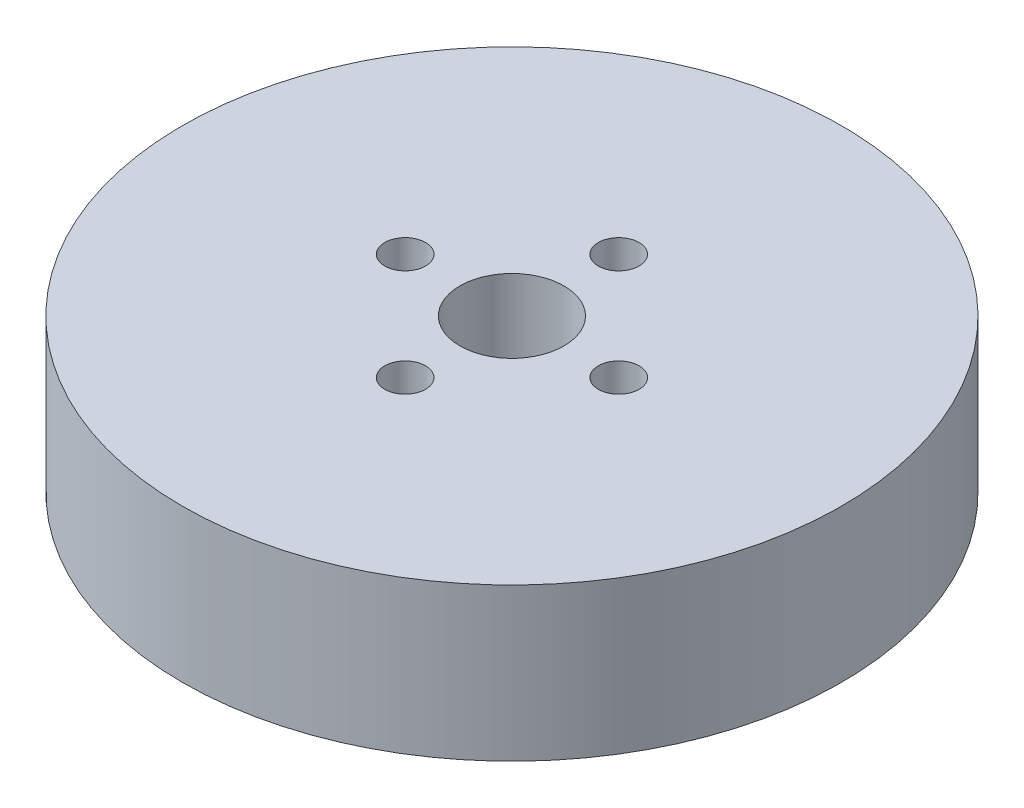
ISO-10303-21;
HEADER;
FILE_DESCRIPTION(('STEP AP214'),'2;1');
FILE_NAME('part.step','',(''),(''),'','','');
FILE_SCHEMA(('AUTOMOTIVE_DESIGN { 1 0 10303 214 1 1 1 1 }'));
ENDSEC;
DATA;
#1=APPLICATION_CONTEXT('core data for automotive mechanical design processes');
#2=APPLICATION_PROTOCOL_DEFINITION('international standard','automotive_design',2000,#1);
#3=PRODUCT_CONTEXT('',#1,'mechanical');
#4=PRODUCT('Part','Part','',(#3));
#5=PRODUCT_RELATED_PRODUCT_CATEGORY('part','',(#4));
#6=PRODUCT_DEFINITION_FORMATION('','',#4);
#7=PRODUCT_DEFINITION_CONTEXT('part definition',#1,'design');
#8=PRODUCT_DEFINITION('design','',#6,#7);
#9=PRODUCT_DEFINITION_SHAPE('','',#8);
#10=(LENGTH_UNIT() NAMED_UNIT(*) SI_UNIT(.MILLI.,.METRE.));
#11=(NAMED_UNIT(*) PLANE_ANGLE_UNIT() SI_UNIT($,.RADIAN.));
#12=(NAMED_UNIT(*) SI_UNIT($,.STERADIAN.) SOLID_ANGLE_UNIT());
#13=UNCERTAINTY_MEASURE_WITH_UNIT(LENGTH_MEASURE(1.E-05),#10,'distance_accuracy_value','');
#14=(GEOMETRIC_REPRESENTATION_CONTEXT(3) GLOBAL_UNCERTAINTY_ASSIGNED_CONTEXT((#13)) GLOBAL_UNIT_ASSIGNED_CONTEXT((#10,
#11,#12)) REPRESENTATION_CONTEXT('',''));
#15=CARTESIAN_POINT('',(0.,0.,0.));
#16=DIRECTION('',(0.,0.,1.));
#17=DIRECTION('',(1.,0.,0.));
#18=AXIS2_PLACEMENT_3D('',#15,#16,#17);
#19=CARTESIAN_POINT('',(0.,22.,0.));
#20=DIRECTION('',(0.,-1.,0.));
#21=DIRECTION('',(0.,0.,-1.));
#22=AXIS2_PLACEMENT_3D('',#19,#20,#21);
#23=CYLINDRICAL_SURFACE('',#22,47.5);
#24=CARTESIAN_POINT('',(0.,22.,0.));
#25=DIRECTION('',(0.,1.,0.));
#26=DIRECTION('',(0.,0.,1.));
#27=AXIS2_PLACEMENT_3D('',#24,#25,#26);
#28=CIRCLE('',#27,47.5);
#29=CARTESIAN_POINT('',(0.,22.,47.5));
#30=VERTEX_POINT('',#29);
#31=EDGE_CURVE('E10',#30,#30,#28,.T.);
#32=ORIENTED_EDGE('',*,*,#31,.F.);
#33=EDGE_LOOP('',(#32));
#34=FACE_BOUND('',#33,.T.);
#35=CARTESIAN_POINT('',(0.,0.,0.));
#36=DIRECTION('',(0.,1.,0.));
#37=DIRECTION('',(0.,0.,1.));
#38=AXIS2_PLACEMENT_3D('',#35,#36,#37);
#39=CIRCLE('',#38,47.5);
#40=CARTESIAN_POINT('',(0.,0.,47.5));
#41=VERTEX_POINT('',#40);
#42=EDGE_CURVE('E37',#41,#41,#39,.T.);
#43=ORIENTED_EDGE('',*,*,#42,.T.);
#44=EDGE_LOOP('',(#43));
#45=FACE_BOUND('',#44,.T.);
#46=ADVANCED_FACE('F40',(#34,#45),#23,.T.);
#47=CARTESIAN_POINT('',(0.,22.,0.));
#48=DIRECTION('',(0.,1.,0.));
#49=DIRECTION('',(0.,0.,1.));
#50=AXIS2_PLACEMENT_3D('',#47,#48,#49);
#51=PLANE('',#50);
#52=CARTESIAN_POINT('',(0.,22.,15.3892783760193));
#53=DIRECTION('',(0.,1.,0.));
#54=DIRECTION('',(1.,0.,0.));
#55=AXIS2_PLACEMENT_3D('',#52,#53,#54);
#56=CIRCLE('',#55,2.9412530173602);
#57=CARTESIAN_POINT('',(2.94125301736025,22.,15.3892783760193));
#58=VERTEX_POINT('',#57);
#59=EDGE_CURVE('E71',#58,#58,#56,.T.);
#60=ORIENTED_EDGE('',*,*,#59,.F.);
#61=EDGE_LOOP('',(#60));
#62=FACE_BOUND('',#61,.T.);
#63=CARTESIAN_POINT('',(15.3892783760193,22.,0.));
#64=DIRECTION('',(0.,1.,0.));
#65=DIRECTION('',(0.,0.,-1.));
#66=AXIS2_PLACEMENT_3D('',#63,#64,#65);
#67=CIRCLE('',#66,2.9412530173602);
#68=CARTESIAN_POINT('',(15.3892783760193,22.,-2.9412530173602));
#69=VERTEX_POINT('',#68);
#70=EDGE_CURVE('E70',#69,#69,#67,.T.);
#71=ORIENTED_EDGE('',*,*,#70,.F.);
#72=EDGE_LOOP('',(#71));
#73=FACE_BOUND('',#72,.T.);
#74=CARTESIAN_POINT('',(-1.61194134804401E-13,22.,-15.3892783760193));
#75=DIRECTION('',(0.,1.,0.));
#76=DIRECTION('',(-1.,0.,0.));
#77=AXIS2_PLACEMENT_3D('',#74,#75,#76);
#78=CIRCLE('',#77,2.9412530173602);
#79=CARTESIAN_POINT('',(-2.94125301736036,22.,-15.3892783760193));
#80=VERTEX_POINT('',#79);
#81=EDGE_CURVE('E61',#80,#80,#78,.T.);
#82=ORIENTED_EDGE('',*,*,#81,.F.);
#83=EDGE_LOOP('',(#82));
#84=FACE_BOUND('',#83,.T.);
#85=CARTESIAN_POINT('',(-15.3892783760193,22.,0.));
#86=DIRECTION('',(0.,1.,0.));
#87=DIRECTION('',(0.,0.,1.));
#88=AXIS2_PLACEMENT_3D('',#85,#86,#87);
#89=CIRCLE('',#88,2.9412530173602);
#90=CARTESIAN_POINT('',(-15.3892783760193,22.,2.9412530173602));
#91=VERTEX_POINT('',#90);
#92=EDGE_CURVE('E54',#91,#91,#89,.T.);
#93=ORIENTED_EDGE('',*,*,#92,.F.);
#94=EDGE_LOOP('',(#93));
#95=FACE_BOUND('',#94,.T.);
#96=CARTESIAN_POINT('',(0.,22.,0.));
#97=DIRECTION('',(0.,1.,0.));
#98=DIRECTION('',(0.,0.,1.));
#99=AXIS2_PLACEMENT_3D('',#96,#97,#98);
#100=CIRCLE('',#99,7.5);
#101=CARTESIAN_POINT('',(0.,22.,7.5));
#102=VERTEX_POINT('',#101);
#103=EDGE_CURVE('E50',#102,#102,#100,.T.);
#104=ORIENTED_EDGE('',*,*,#103,.F.);
#105=EDGE_LOOP('',(#104));
#106=FACE_BOUND('',#105,.T.);
#107=ORIENTED_EDGE('',*,*,#31,.T.);
#108=EDGE_LOOP('',(#107));
#109=FACE_BOUND('',#108,.T.);
#110=ADVANCED_FACE('F86',(#62,#73,#84,#95,#106,#109),#51,.T.);
#111=CARTESIAN_POINT('',(0.,0.,0.));
#112=DIRECTION('',(0.,1.,0.));
#113=DIRECTION('',(0.,0.,1.));
#114=AXIS2_PLACEMENT_3D('',#111,#112,#113);
#115=PLANE('',#114);
#116=CARTESIAN_POINT('',(0.,0.,0.));
#117=DIRECTION('',(0.,1.,0.));
#118=DIRECTION('',(0.,0.,1.));
#119=AXIS2_PLACEMENT_3D('',#116,#117,#118);
#120=CIRCLE('',#119,7.5);
#121=CARTESIAN_POINT('',(0.,0.,7.5));
#122=VERTEX_POINT('',#121);
#123=EDGE_CURVE('E47',#122,#122,#120,.T.);
#124=ORIENTED_EDGE('',*,*,#123,.T.);
#125=EDGE_LOOP('',(#124));
#126=FACE_BOUND('',#125,.T.);
#127=ORIENTED_EDGE('',*,*,#42,.F.);
#128=EDGE_LOOP('',(#127));
#129=FACE_BOUND('',#128,.T.);
#130=ADVANCED_FACE('F93',(#126,#129),#115,.F.);
#131=CARTESIAN_POINT('',(0.,22.,0.));
#132=DIRECTION('',(0.,-1.,0.));
#133=DIRECTION('',(0.,0.,-1.));
#134=AXIS2_PLACEMENT_3D('',#131,#132,#133);
#135=CYLINDRICAL_SURFACE('',#134,7.5);
#136=ORIENTED_EDGE('',*,*,#103,.T.);
#137=EDGE_LOOP('',(#136));
#138=FACE_BOUND('',#137,.T.);
#139=ORIENTED_EDGE('',*,*,#123,.F.);
#140=EDGE_LOOP('',(#139));
#141=FACE_BOUND('',#140,.T.);
#142=ADVANCED_FACE('F101',(#138,#141),#135,.F.);
#143=CARTESIAN_POINT('',(-15.3892783760193,4.77755691527927,0.));
#144=DIRECTION('',(0.,1.,0.));
#145=DIRECTION('',(0.,0.,1.));
#146=AXIS2_PLACEMENT_3D('',#143,#144,#145);
#147=CYLINDRICAL_SURFACE('',#146,2.9412530173602);
#148=CARTESIAN_POINT('',(-15.3892783760193,4.77755691527927,0.));
#149=DIRECTION('',(0.,1.,0.));
#150=DIRECTION('',(0.,0.,1.));
#151=AXIS2_PLACEMENT_3D('',#148,#149,#150);
#152=CIRCLE('',#151,2.9412530173602);
#153=CARTESIAN_POINT('',(-15.3892783760193,4.77755691527927,2.9412530173602));
#154=VERTEX_POINT('',#153);
#155=EDGE_CURVE('E55',#154,#154,#152,.T.);
#156=ORIENTED_EDGE('',*,*,#155,.F.);
#157=EDGE_LOOP('',(#156));
#158=FACE_BOUND('',#157,.T.);
#159=ORIENTED_EDGE('',*,*,#92,.T.);
#160=EDGE_LOOP('',(#159));
#161=FACE_BOUND('',#160,.T.);
#162=ADVANCED_FACE('F102',(#158,#161),#147,.F.);
#163=CARTESIAN_POINT('',(-15.3892783760193,4.77755691527927,0.));
#164=DIRECTION('',(0.,1.,0.));
#165=DIRECTION('',(0.,0.,1.));
#166=AXIS2_PLACEMENT_3D('',#163,#164,#165);
#167=PLANE('',#166);
#168=ORIENTED_EDGE('',*,*,#155,.T.);
#169=EDGE_LOOP('',(#168));
#170=FACE_BOUND('',#169,.T.);
#171=ADVANCED_FACE('F133',(#170),#167,.T.);
#172=CARTESIAN_POINT('',(-1.61194134804401E-13,4.77755691527927,-15.3892783760193));
#173=DIRECTION('',(0.,1.,0.));
#174=DIRECTION('',(0.,0.,1.));
#175=AXIS2_PLACEMENT_3D('',#172,#173,#174);
#176=CYLINDRICAL_SURFACE('',#175,2.9412530173602);
#177=CARTESIAN_POINT('',(-1.61194134804401E-13,4.77755691527927,-15.3892783760193));
#178=DIRECTION('',(0.,1.,0.));
#179=DIRECTION('',(-1.,0.,0.));
#180=AXIS2_PLACEMENT_3D('',#177,#178,#179);
#181=CIRCLE('',#180,2.9412530173602);
#182=CARTESIAN_POINT('',(-2.94125301736036,4.77755691527927,-15.3892783760193));
#183=VERTEX_POINT('',#182);
#184=EDGE_CURVE('E63',#183,#183,#181,.T.);
#185=ORIENTED_EDGE('',*,*,#184,.F.);
#186=EDGE_LOOP('',(#185));
#187=FACE_BOUND('',#186,.T.);
#188=ORIENTED_EDGE('',*,*,#81,.T.);
#189=EDGE_LOOP('',(#188));
#190=FACE_BOUND('',#189,.T.);
#191=ADVANCED_FACE('F142',(#187,#190),#176,.F.);
#192=CARTESIAN_POINT('',(-1.61194134804401E-13,4.77755691527927,-15.3892783760193));
#193=DIRECTION('',(0.,1.,0.));
#194=DIRECTION('',(-1.,0.,0.));
#195=AXIS2_PLACEMENT_3D('',#192,#193,#194);
#196=PLANE('',#195);
#197=ORIENTED_EDGE('',*,*,#184,.T.);
#198=EDGE_LOOP('',(#197));
#199=FACE_BOUND('',#198,.T.);
#200=ADVANCED_FACE('F156',(#199),#196,.T.);
#201=CARTESIAN_POINT('',(15.3892783760193,4.77755691527927,0.));
#202=DIRECTION('',(0.,1.,0.));
#203=DIRECTION('',(0.,0.,1.));
#204=AXIS2_PLACEMENT_3D('',#201,#202,#203);
#205=CYLINDRICAL_SURFACE('',#204,2.9412530173602);
#206=CARTESIAN_POINT('',(15.3892783760193,4.77755691527927,0.));
#207=DIRECTION('',(0.,1.,0.));
#208=DIRECTION('',(0.,0.,-1.));
#209=AXIS2_PLACEMENT_3D('',#206,#207,#208);
#210=CIRCLE('',#209,2.9412530173602);
#211=CARTESIAN_POINT('',(15.3892783760193,4.77755691527927,-2.9412530173602));
#212=VERTEX_POINT('',#211);
#213=EDGE_CURVE('E69',#212,#212,#210,.T.);
#214=ORIENTED_EDGE('',*,*,#213,.F.);
#215=EDGE_LOOP('',(#214));
#216=FACE_BOUND('',#215,.T.);
#217=ORIENTED_EDGE('',*,*,#70,.T.);
#218=EDGE_LOOP('',(#217));
#219=FACE_BOUND('',#218,.T.);
#220=ADVANCED_FACE('F164',(#216,#219),#205,.F.);
#221=CARTESIAN_POINT('',(15.3892783760193,4.77755691527927,0.));
#222=DIRECTION('',(0.,1.,0.));
#223=DIRECTION('',(0.,0.,-1.));
#224=AXIS2_PLACEMENT_3D('',#221,#222,#223);
#225=PLANE('',#224);
#226=ORIENTED_EDGE('',*,*,#213,.T.);
#227=EDGE_LOOP('',(#226));
#228=FACE_BOUND('',#227,.T.);
#229=ADVANCED_FACE('F83',(#228),#225,.T.);
#230=CARTESIAN_POINT('',(0.,4.77755691527927,15.3892783760193));
#231=DIRECTION('',(0.,1.,0.));
#232=DIRECTION('',(0.,0.,1.));
#233=AXIS2_PLACEMENT_3D('',#230,#231,#232);
#234=CYLINDRICAL_SURFACE('',#233,2.9412530173602);
#235=CARTESIAN_POINT('',(0.,4.77755691527927,15.3892783760193));
#236=DIRECTION('',(0.,1.,0.));
#237=DIRECTION('',(1.,0.,0.));
#238=AXIS2_PLACEMENT_3D('',#235,#236,#237);
#239=CIRCLE('',#238,2.9412530173602);
#240=CARTESIAN_POINT('',(2.94125301736025,4.77755691527927,15.3892783760193));
#241=VERTEX_POINT('',#240);
#242=EDGE_CURVE('E59',#241,#241,#239,.T.);
#243=ORIENTED_EDGE('',*,*,#242,.F.);
#244=EDGE_LOOP('',(#243));
#245=FACE_BOUND('',#244,.T.);
#246=ORIENTED_EDGE('',*,*,#59,.T.);
#247=EDGE_LOOP('',(#246));
#248=FACE_BOUND('',#247,.T.);
#249=ADVANCED_FACE('F81',(#245,#248),#234,.F.);
#250=CARTESIAN_POINT('',(0.,4.77755691527927,15.3892783760193));
#251=DIRECTION('',(0.,1.,0.));
#252=DIRECTION('',(1.,0.,0.));
#253=AXIS2_PLACEMENT_3D('',#250,#251,#252);
#254=PLANE('',#253);
#255=ORIENTED_EDGE('',*,*,#242,.T.);
#256=EDGE_LOOP('',(#255));
#257=FACE_BOUND('',#256,.T.);
#258=ADVANCED_FACE('F78',(#257),#254,.T.);
#259=CLOSED_SHELL('',(#46,#110,#130,#142,#162,#171,#191,#200,#220,#229,#249,#258));
#260=MANIFOLD_SOLID_BREP('B2',#259);
#261=ADVANCED_BREP_SHAPE_REPRESENTATION('',(#18,#260),#14);
#262=SHAPE_DEFINITION_REPRESENTATION(#9,#261);
ENDSEC;
END-ISO-10303-21;
